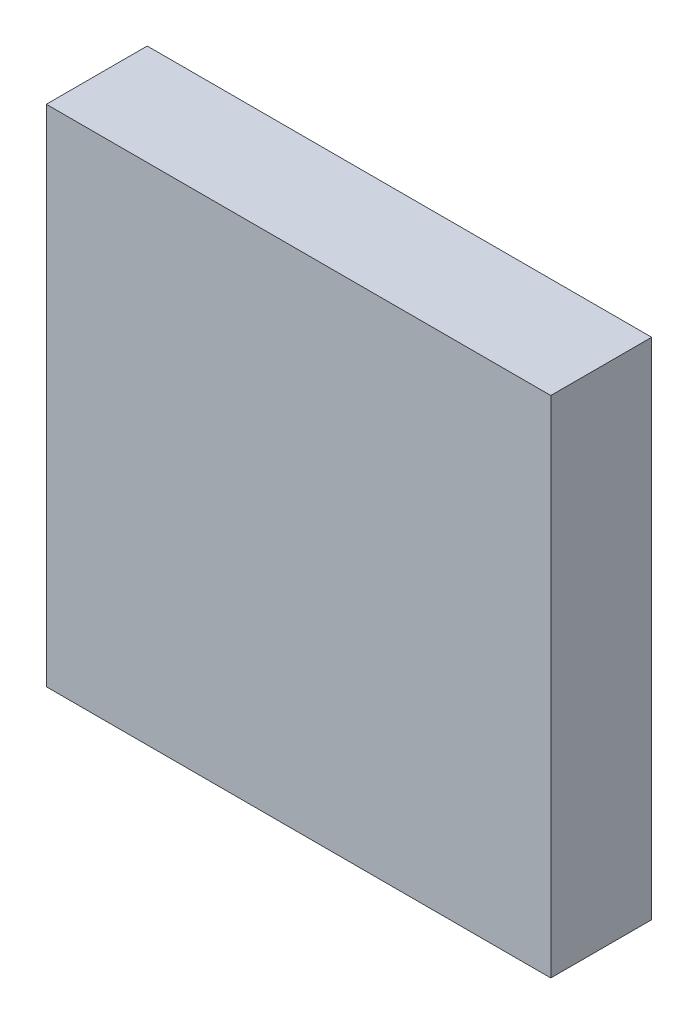
ISO-10303-21;
HEADER;
FILE_DESCRIPTION(('STEP AP214'),'2;1');
FILE_NAME('part.step','',(''),(''),'','','');
FILE_SCHEMA(('AUTOMOTIVE_DESIGN { 1 0 10303 214 1 1 1 1 }'));
ENDSEC;
DATA;
#1=APPLICATION_CONTEXT('core data for automotive mechanical design processes');
#2=APPLICATION_PROTOCOL_DEFINITION('international standard','automotive_design',2000,#1);
#3=PRODUCT_CONTEXT('',#1,'mechanical');
#4=PRODUCT('Part','Part','',(#3));
#5=PRODUCT_RELATED_PRODUCT_CATEGORY('part','',(#4));
#6=PRODUCT_DEFINITION_FORMATION('','',#4);
#7=PRODUCT_DEFINITION_CONTEXT('part definition',#1,'design');
#8=PRODUCT_DEFINITION('design','',#6,#7);
#9=PRODUCT_DEFINITION_SHAPE('','',#8);
#10=(LENGTH_UNIT() NAMED_UNIT(*) SI_UNIT(.MILLI.,.METRE.));
#11=(NAMED_UNIT(*) PLANE_ANGLE_UNIT() SI_UNIT($,.RADIAN.));
#12=(NAMED_UNIT(*) SI_UNIT($,.STERADIAN.) SOLID_ANGLE_UNIT());
#13=UNCERTAINTY_MEASURE_WITH_UNIT(LENGTH_MEASURE(1.E-05),#10,'distance_accuracy_value','');
#14=(GEOMETRIC_REPRESENTATION_CONTEXT(3) GLOBAL_UNCERTAINTY_ASSIGNED_CONTEXT((#13)) GLOBAL_UNIT_ASSIGNED_CONTEXT((#10,
#11,#12)) REPRESENTATION_CONTEXT('',''));
#15=CARTESIAN_POINT('',(0.,0.,0.));
#16=DIRECTION('',(0.,0.,1.));
#17=DIRECTION('',(1.,0.,0.));
#18=AXIS2_PLACEMENT_3D('',#15,#16,#17);
#19=CARTESIAN_POINT('',(2.,-2.,0.8));
#20=DIRECTION('',(-1.,0.,0.));
#21=DIRECTION('',(0.,0.,1.));
#22=AXIS2_PLACEMENT_3D('',#19,#20,#21);
#23=PLANE('',#22);
#24=DIRECTION('',(0.,1.,0.));
#25=VECTOR('',#24,1.);
#26=CARTESIAN_POINT('',(2.,-2.,0.));
#27=LINE('',#26,#25);
#28=CARTESIAN_POINT('',(2.,-2.,0.));
#29=VERTEX_POINT('',#28);
#30=CARTESIAN_POINT('',(2.,2.,0.));
#31=VERTEX_POINT('',#30);
#32=EDGE_CURVE('E99',#29,#31,#27,.T.);
#33=ORIENTED_EDGE('',*,*,#32,.T.);
#34=DIRECTION('',(0.,0.,-1.));
#35=VECTOR('',#34,1.);
#36=CARTESIAN_POINT('',(2.,2.,0.8));
#37=LINE('',#36,#35);
#38=CARTESIAN_POINT('',(2.,2.,0.8));
#39=VERTEX_POINT('',#38);
#40=EDGE_CURVE('E11',#39,#31,#37,.T.);
#41=ORIENTED_EDGE('',*,*,#40,.F.);
#42=DIRECTION('',(0.,1.,0.));
#43=VECTOR('',#42,1.);
#44=CARTESIAN_POINT('',(2.,-2.,0.8));
#45=LINE('',#44,#43);
#46=CARTESIAN_POINT('',(2.,-2.,0.8));
#47=VERTEX_POINT('',#46);
#48=EDGE_CURVE('E87',#47,#39,#45,.T.);
#49=ORIENTED_EDGE('',*,*,#48,.F.);
#50=DIRECTION('',(0.,0.,-1.));
#51=VECTOR('',#50,1.);
#52=CARTESIAN_POINT('',(2.,-2.,0.8));
#53=LINE('',#52,#51);
#54=EDGE_CURVE('E95',#47,#29,#53,.T.);
#55=ORIENTED_EDGE('',*,*,#54,.T.);
#56=EDGE_LOOP('',(#33,#41,#49,#55));
#57=FACE_BOUND('',#56,.T.);
#58=ADVANCED_FACE('F36',(#57),#23,.F.);
#59=CARTESIAN_POINT('',(-2.,2.,0.8));
#60=DIRECTION('',(0.,-1.,0.));
#61=DIRECTION('',(0.,0.,-1.));
#62=AXIS2_PLACEMENT_3D('',#59,#60,#61);
#63=PLANE('',#62);
#64=DIRECTION('',(-1.,0.,0.));
#65=VECTOR('',#64,1.);
#66=CARTESIAN_POINT('',(-2.,2.,0.));
#67=LINE('',#66,#65);
#68=CARTESIAN_POINT('',(-2.,2.,0.));
#69=VERTEX_POINT('',#68);
#70=EDGE_CURVE('E91',#31,#69,#67,.T.);
#71=ORIENTED_EDGE('',*,*,#70,.T.);
#72=DIRECTION('',(0.,0.,-1.));
#73=VECTOR('',#72,1.);
#74=CARTESIAN_POINT('',(-2.,2.,0.8));
#75=LINE('',#74,#73);
#76=CARTESIAN_POINT('',(-2.,2.,0.8));
#77=VERTEX_POINT('',#76);
#78=EDGE_CURVE('E44',#77,#69,#75,.T.);
#79=ORIENTED_EDGE('',*,*,#78,.F.);
#80=DIRECTION('',(-1.,0.,0.));
#81=VECTOR('',#80,1.);
#82=CARTESIAN_POINT('',(-2.,2.,0.8));
#83=LINE('',#82,#81);
#84=EDGE_CURVE('E82',#39,#77,#83,.T.);
#85=ORIENTED_EDGE('',*,*,#84,.F.);
#86=ORIENTED_EDGE('',*,*,#40,.T.);
#87=EDGE_LOOP('',(#71,#79,#85,#86));
#88=FACE_BOUND('',#87,.T.);
#89=ADVANCED_FACE('F90',(#88),#63,.F.);
#90=CARTESIAN_POINT('',(-2.,-2.,0.8));
#91=DIRECTION('',(1.,0.,0.));
#92=DIRECTION('',(0.,0.,-1.));
#93=AXIS2_PLACEMENT_3D('',#90,#91,#92);
#94=PLANE('',#93);
#95=DIRECTION('',(0.,-1.,0.));
#96=VECTOR('',#95,1.);
#97=CARTESIAN_POINT('',(-2.,-2.,0.));
#98=LINE('',#97,#96);
#99=CARTESIAN_POINT('',(-2.,-2.,0.));
#100=VERTEX_POINT('',#99);
#101=EDGE_CURVE('E69',#69,#100,#98,.T.);
#102=ORIENTED_EDGE('',*,*,#101,.T.);
#103=DIRECTION('',(0.,0.,-1.));
#104=VECTOR('',#103,1.);
#105=CARTESIAN_POINT('',(-2.,-2.,0.8));
#106=LINE('',#105,#104);
#107=CARTESIAN_POINT('',(-2.,-2.,0.8));
#108=VERTEX_POINT('',#107);
#109=EDGE_CURVE('E92',#108,#100,#106,.T.);
#110=ORIENTED_EDGE('',*,*,#109,.F.);
#111=DIRECTION('',(0.,-1.,0.));
#112=VECTOR('',#111,1.);
#113=CARTESIAN_POINT('',(-2.,-2.,0.8));
#114=LINE('',#113,#112);
#115=EDGE_CURVE('E85',#77,#108,#114,.T.);
#116=ORIENTED_EDGE('',*,*,#115,.F.);
#117=ORIENTED_EDGE('',*,*,#78,.T.);
#118=EDGE_LOOP('',(#102,#110,#116,#117));
#119=FACE_BOUND('',#118,.T.);
#120=ADVANCED_FACE('F93',(#119),#94,.F.);
#121=CARTESIAN_POINT('',(-2.,-2.,0.8));
#122=DIRECTION('',(0.,1.,0.));
#123=DIRECTION('',(0.,0.,1.));
#124=AXIS2_PLACEMENT_3D('',#121,#122,#123);
#125=PLANE('',#124);
#126=DIRECTION('',(1.,0.,0.));
#127=VECTOR('',#126,1.);
#128=CARTESIAN_POINT('',(-2.,-2.,0.));
#129=LINE('',#128,#127);
#130=EDGE_CURVE('E75',#100,#29,#129,.T.);
#131=ORIENTED_EDGE('',*,*,#130,.T.);
#132=ORIENTED_EDGE('',*,*,#54,.F.);
#133=DIRECTION('',(1.,0.,0.));
#134=VECTOR('',#133,1.);
#135=CARTESIAN_POINT('',(-2.,-2.,0.8));
#136=LINE('',#135,#134);
#137=EDGE_CURVE('E52',#108,#47,#136,.T.);
#138=ORIENTED_EDGE('',*,*,#137,.F.);
#139=ORIENTED_EDGE('',*,*,#109,.T.);
#140=EDGE_LOOP('',(#131,#132,#138,#139));
#141=FACE_BOUND('',#140,.T.);
#142=ADVANCED_FACE('F106',(#141),#125,.F.);
#143=CARTESIAN_POINT('',(0.,0.,0.8));
#144=DIRECTION('',(0.,0.,-1.));
#145=DIRECTION('',(-1.,0.,0.));
#146=AXIS2_PLACEMENT_3D('',#143,#144,#145);
#147=PLANE('',#146);
#148=ORIENTED_EDGE('',*,*,#48,.T.);
#149=ORIENTED_EDGE('',*,*,#84,.T.);
#150=ORIENTED_EDGE('',*,*,#115,.T.);
#151=ORIENTED_EDGE('',*,*,#137,.T.);
#152=EDGE_LOOP('',(#148,#149,#150,#151));
#153=FACE_BOUND('',#152,.T.);
#154=ADVANCED_FACE('F83',(#153),#147,.F.);
#155=CARTESIAN_POINT('',(0.,0.,0.));
#156=DIRECTION('',(0.,0.,-1.));
#157=DIRECTION('',(-1.,0.,0.));
#158=AXIS2_PLACEMENT_3D('',#155,#156,#157);
#159=PLANE('',#158);
#160=ORIENTED_EDGE('',*,*,#32,.F.);
#161=ORIENTED_EDGE('',*,*,#130,.F.);
#162=ORIENTED_EDGE('',*,*,#101,.F.);
#163=ORIENTED_EDGE('',*,*,#70,.F.);
#164=EDGE_LOOP('',(#160,#161,#162,#163));
#165=FACE_BOUND('',#164,.T.);
#166=ADVANCED_FACE('F109',(#165),#159,.T.);
#167=CLOSED_SHELL('',(#58,#89,#120,#142,#154,#166));
#168=MANIFOLD_SOLID_BREP('B2',#167);
#169=ADVANCED_BREP_SHAPE_REPRESENTATION('',(#18,#168),#14);
#170=SHAPE_DEFINITION_REPRESENTATION(#9,#169);
ENDSEC;
END-ISO-10303-21;
